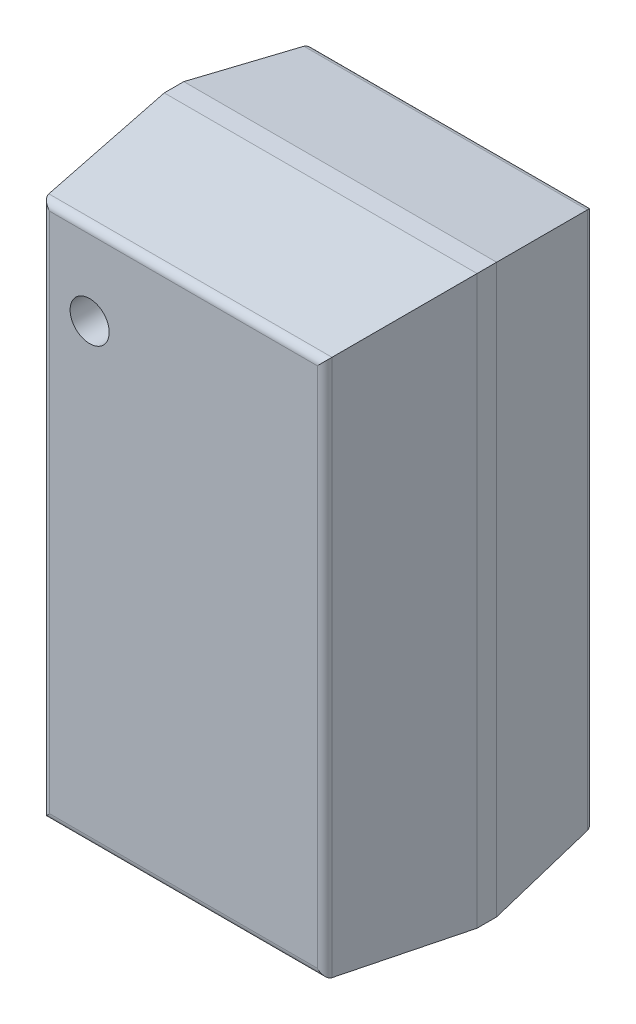
ISO-10303-21;
HEADER;
FILE_DESCRIPTION(('STEP AP214'),'2;1');
FILE_NAME('part.step','',(''),(''),'','','');
FILE_SCHEMA(('AUTOMOTIVE_DESIGN { 1 0 10303 214 1 1 1 1 }'));
ENDSEC;
DATA;
#1=APPLICATION_CONTEXT('core data for automotive mechanical design processes');
#2=APPLICATION_PROTOCOL_DEFINITION('international standard','automotive_design',2000,#1);
#3=PRODUCT_CONTEXT('',#1,'mechanical');
#4=PRODUCT('Part','Part','',(#3));
#5=PRODUCT_RELATED_PRODUCT_CATEGORY('part','',(#4));
#6=PRODUCT_DEFINITION_FORMATION('','',#4);
#7=PRODUCT_DEFINITION_CONTEXT('part definition',#1,'design');
#8=PRODUCT_DEFINITION('design','',#6,#7);
#9=PRODUCT_DEFINITION_SHAPE('','',#8);
#10=(LENGTH_UNIT() NAMED_UNIT(*) SI_UNIT(.MILLI.,.METRE.));
#11=(NAMED_UNIT(*) PLANE_ANGLE_UNIT() SI_UNIT($,.RADIAN.));
#12=(NAMED_UNIT(*) SI_UNIT($,.STERADIAN.) SOLID_ANGLE_UNIT());
#13=UNCERTAINTY_MEASURE_WITH_UNIT(LENGTH_MEASURE(1.E-05),#10,'distance_accuracy_value','');
#14=(GEOMETRIC_REPRESENTATION_CONTEXT(3) GLOBAL_UNCERTAINTY_ASSIGNED_CONTEXT((#13)) GLOBAL_UNIT_ASSIGNED_CONTEXT((#10,
#11,#12)) REPRESENTATION_CONTEXT('',''));
#15=CARTESIAN_POINT('',(0.,0.,0.));
#16=DIRECTION('',(0.,0.,1.));
#17=DIRECTION('',(1.,0.,0.));
#18=AXIS2_PLACEMENT_3D('',#15,#16,#17);
#19=CARTESIAN_POINT('',(-0.48,0.95,1.305));
#20=DIRECTION('',(0.,0.,1.));
#21=DIRECTION('',(1.,0.,0.));
#22=AXIS2_PLACEMENT_3D('',#19,#20,#21);
#23=PLANE('',#22);
#24=CARTESIAN_POINT('',(-0.48,0.95,1.305));
#25=DIRECTION('',(0.,0.,1.));
#26=DIRECTION('',(1.,0.,0.));
#27=AXIS2_PLACEMENT_3D('',#24,#25,#26);
#28=CIRCLE('',#27,0.1);
#29=CARTESIAN_POINT('',(-0.38,0.95,1.305));
#30=VERTEX_POINT('',#29);
#31=EDGE_CURVE('E25',#30,#30,#28,.T.);
#32=ORIENTED_EDGE('',*,*,#31,.T.);
#33=EDGE_LOOP('',(#32));
#34=FACE_BOUND('',#33,.T.);
#35=ADVANCED_FACE('F17',(#34),#23,.T.);
#36=CARTESIAN_POINT('',(-0.48,0.95,1.305));
#37=DIRECTION('',(0.,0.,1.));
#38=DIRECTION('',(1.,0.,0.));
#39=AXIS2_PLACEMENT_3D('',#36,#37,#38);
#40=CYLINDRICAL_SURFACE('',#39,0.1);
#41=ORIENTED_EDGE('',*,*,#31,.F.);
#42=DIRECTION('',(0.,0.,1.));
#43=VECTOR('',#42,1.);
#44=CARTESIAN_POINT('',(-0.38,0.95,1.305));
#45=LINE('',#44,#43);
#46=CARTESIAN_POINT('',(-0.38,0.95,1.45));
#47=VERTEX_POINT('',#46);
#48=EDGE_CURVE('E11',#30,#47,#45,.T.);
#49=ORIENTED_EDGE('',*,*,#48,.T.);
#50=CARTESIAN_POINT('',(-0.48,0.95,1.45));
#51=DIRECTION('',(0.,0.,1.));
#52=DIRECTION('',(1.,0.,0.));
#53=AXIS2_PLACEMENT_3D('',#50,#51,#52);
#54=CIRCLE('',#53,0.1);
#55=EDGE_CURVE('E192',#47,#47,#54,.T.);
#56=ORIENTED_EDGE('',*,*,#55,.T.);
#57=ORIENTED_EDGE('',*,*,#48,.F.);
#58=EDGE_LOOP('',(#41,#49,#56,#57));
#59=FACE_BOUND('',#58,.T.);
#60=ADVANCED_FACE('F257',(#59),#40,.F.);
#61=CARTESIAN_POINT('',(0.68430217805,-1.37,1.41));
#62=DIRECTION('',(0.,1.,0.));
#63=DIRECTION('',(0.,0.,1.));
#64=AXIS2_PLACEMENT_3D('',#61,#62,#63);
#65=CYLINDRICAL_SURFACE('',#64,0.04);
#66=CARTESIAN_POINT('',(0.68430217805,-1.33430217805,1.41));
#67=DIRECTION('',(-0.707106781186548,-0.707106781186548,0.));
#68=DIRECTION('',(0.707106781186548,-0.707106781186548,0.));
#69=AXIS2_PLACEMENT_3D('',#66,#67,#68);
#70=ELLIPSE('',#69,0.05656854249492,0.04);
#71=CARTESIAN_POINT('',(0.724044605579,-1.374044605579,1.414532047456));
#72=VERTEX_POINT('',#71);
#73=CARTESIAN_POINT('',(0.68430217805,-1.33430217805,1.45));
#74=VERTEX_POINT('',#73);
#75=EDGE_CURVE('E241',#72,#74,#70,.T.);
#76=ORIENTED_EDGE('',*,*,#75,.F.);
#77=DIRECTION('',(0.,1.,0.));
#78=VECTOR('',#77,1.);
#79=CARTESIAN_POINT('',(0.724044605579,-1.37,1.414532047456));
#80=LINE('',#79,#78);
#81=CARTESIAN_POINT('',(0.724044605579,1.374044605579,1.414532047456));
#82=VERTEX_POINT('',#81);
#83=EDGE_CURVE('E147',#72,#82,#80,.T.);
#84=ORIENTED_EDGE('',*,*,#83,.T.);
#85=CARTESIAN_POINT('',(0.68430217805,1.33430217805,1.41));
#86=DIRECTION('',(-0.707106781186548,0.707106781186548,0.));
#87=DIRECTION('',(0.707106781186548,0.707106781186548,0.));
#88=AXIS2_PLACEMENT_3D('',#85,#86,#87);
#89=ELLIPSE('',#88,0.05656854249492,0.04);
#90=CARTESIAN_POINT('',(0.68430217805,1.33430217805,1.45));
#91=VERTEX_POINT('',#90);
#92=EDGE_CURVE('E193',#91,#82,#89,.T.);
#93=ORIENTED_EDGE('',*,*,#92,.F.);
#94=DIRECTION('',(0.,1.,0.));
#95=VECTOR('',#94,1.);
#96=CARTESIAN_POINT('',(0.68430217805,-1.37,1.45));
#97=LINE('',#96,#95);
#98=EDGE_CURVE('E249',#74,#91,#97,.T.);
#99=ORIENTED_EDGE('',*,*,#98,.F.);
#100=EDGE_LOOP('',(#76,#84,#93,#99));
#101=FACE_BOUND('',#100,.T.);
#102=ADVANCED_FACE('F259',(#101),#65,.T.);
#103=CARTESIAN_POINT('',(-0.72,1.33430217805,1.41));
#104=DIRECTION('',(1.,0.,0.));
#105=DIRECTION('',(0.,0.,1.));
#106=AXIS2_PLACEMENT_3D('',#103,#104,#105);
#107=CYLINDRICAL_SURFACE('',#106,0.04);
#108=DIRECTION('',(1.,0.,0.));
#109=VECTOR('',#108,1.);
#110=CARTESIAN_POINT('',(-0.72,1.33430217805,1.45));
#111=LINE('',#110,#109);
#112=CARTESIAN_POINT('',(-0.68430217805,1.33430217805,1.45));
#113=VERTEX_POINT('',#112);
#114=EDGE_CURVE('E194',#113,#91,#111,.T.);
#115=ORIENTED_EDGE('',*,*,#114,.T.);
#116=ORIENTED_EDGE('',*,*,#92,.T.);
#117=DIRECTION('',(1.,0.,0.));
#118=VECTOR('',#117,1.);
#119=CARTESIAN_POINT('',(-0.72,1.374044605579,1.414532047456));
#120=LINE('',#119,#118);
#121=CARTESIAN_POINT('',(-0.724044605579,1.374044605579,1.414532047456));
#122=VERTEX_POINT('',#121);
#123=EDGE_CURVE('E237',#122,#82,#120,.T.);
#124=ORIENTED_EDGE('',*,*,#123,.F.);
#125=CARTESIAN_POINT('',(-0.68430217805,1.33430217805,1.41));
#126=DIRECTION('',(0.707106781186548,0.707106781186548,0.));
#127=DIRECTION('',(-0.707106781186548,0.707106781186548,0.));
#128=AXIS2_PLACEMENT_3D('',#125,#126,#127);
#129=ELLIPSE('',#128,0.05656854249492,0.04);
#130=EDGE_CURVE('E233',#122,#113,#129,.T.);
#131=ORIENTED_EDGE('',*,*,#130,.T.);
#132=EDGE_LOOP('',(#115,#116,#124,#131));
#133=FACE_BOUND('',#132,.T.);
#134=ADVANCED_FACE('F265',(#133),#107,.T.);
#135=CARTESIAN_POINT('',(-0.8,-1.45,1.45));
#136=DIRECTION('',(0.,0.,1.));
#137=DIRECTION('',(1.,0.,0.));
#138=AXIS2_PLACEMENT_3D('',#135,#136,#137);
#139=PLANE('',#138);
#140=ORIENTED_EDGE('',*,*,#55,.F.);
#141=EDGE_LOOP('',(#140));
#142=FACE_BOUND('',#141,.T.);
#143=DIRECTION('',(0.,1.,0.));
#144=VECTOR('',#143,1.);
#145=CARTESIAN_POINT('',(-0.68430217805,-1.37,1.45));
#146=LINE('',#145,#144);
#147=CARTESIAN_POINT('',(-0.68430217805,-1.33430217805,1.45));
#148=VERTEX_POINT('',#147);
#149=EDGE_CURVE('E229',#148,#113,#146,.T.);
#150=ORIENTED_EDGE('',*,*,#149,.F.);
#151=DIRECTION('',(1.,0.,0.));
#152=VECTOR('',#151,1.);
#153=CARTESIAN_POINT('',(-0.72,-1.33430217805,1.45));
#154=LINE('',#153,#152);
#155=EDGE_CURVE('E245',#148,#74,#154,.T.);
#156=ORIENTED_EDGE('',*,*,#155,.T.);
#157=ORIENTED_EDGE('',*,*,#98,.T.);
#158=ORIENTED_EDGE('',*,*,#114,.F.);
#159=EDGE_LOOP('',(#150,#156,#157,#158));
#160=FACE_BOUND('',#159,.T.);
#161=ADVANCED_FACE('F271',(#142,#160),#139,.T.);
#162=CARTESIAN_POINT('',(-0.72,-1.33430217805,1.41));
#163=DIRECTION('',(1.,0.,0.));
#164=DIRECTION('',(0.,-0.993560688212825,0.11330118639298));
#165=AXIS2_PLACEMENT_3D('',#162,#163,#164);
#166=CYLINDRICAL_SURFACE('',#165,0.04);
#167=DIRECTION('',(1.,0.,0.));
#168=VECTOR('',#167,1.);
#169=CARTESIAN_POINT('',(-0.72,-1.374044605579,1.414532047456));
#170=LINE('',#169,#168);
#171=CARTESIAN_POINT('',(-0.724044605579,-1.374044605579,1.414532047456));
#172=VERTEX_POINT('',#171);
#173=EDGE_CURVE('E153',#172,#72,#170,.T.);
#174=ORIENTED_EDGE('',*,*,#173,.T.);
#175=ORIENTED_EDGE('',*,*,#75,.T.);
#176=ORIENTED_EDGE('',*,*,#155,.F.);
#177=CARTESIAN_POINT('',(-0.68430217805,-1.33430217805,1.41));
#178=DIRECTION('',(-0.707106781186548,0.707106781186548,0.));
#179=DIRECTION('',(0.707106781186548,0.707106781186548,0.));
#180=AXIS2_PLACEMENT_3D('',#177,#178,#179);
#181=ELLIPSE('',#180,0.05656854249492,0.04);
#182=EDGE_CURVE('E225',#172,#148,#181,.T.);
#183=ORIENTED_EDGE('',*,*,#182,.F.);
#184=EDGE_LOOP('',(#174,#175,#176,#183));
#185=FACE_BOUND('',#184,.T.);
#186=ADVANCED_FACE('F275',(#185),#166,.T.);
#187=CARTESIAN_POINT('',(0.76,-1.45,1.099232026655));
#188=DIRECTION('',(0.993560688212825,0.,0.11330118639298));
#189=DIRECTION('',(0.,-1.,0.));
#190=AXIS2_PLACEMENT_3D('',#187,#188,#189);
#191=PLANE('',#190);
#192=DIRECTION('',(-0.112580881361013,0.112580881361013,0.987244189805114));
#193=VECTOR('',#192,1.);
#194=CARTESIAN_POINT('',(0.750367414316,-1.400367414316,1.18370209062));
#195=LINE('',#194,#193);
#196=CARTESIAN_POINT('',(0.8,-1.45,0.74846405331));
#197=VERTEX_POINT('',#196);
#198=EDGE_CURVE('E140',#197,#72,#195,.T.);
#199=ORIENTED_EDGE('',*,*,#198,.F.);
#200=DIRECTION('',(0.,1.,0.));
#201=VECTOR('',#200,1.);
#202=CARTESIAN_POINT('',(0.8,-1.45,0.74846405331));
#203=LINE('',#202,#201);
#204=CARTESIAN_POINT('',(0.8,1.45,0.74846405331));
#205=VERTEX_POINT('',#204);
#206=EDGE_CURVE('E144',#197,#205,#203,.T.);
#207=ORIENTED_EDGE('',*,*,#206,.T.);
#208=DIRECTION('',(-0.112580881361013,-0.112580881361013,0.987244189805114));
#209=VECTOR('',#208,1.);
#210=CARTESIAN_POINT('',(0.731989454786,1.381989454786,1.344862081079));
#211=LINE('',#210,#209);
#212=EDGE_CURVE('E238',#205,#82,#211,.T.);
#213=ORIENTED_EDGE('',*,*,#212,.T.);
#214=ORIENTED_EDGE('',*,*,#83,.F.);
#215=EDGE_LOOP('',(#199,#207,#213,#214));
#216=FACE_BOUND('',#215,.T.);
#217=ADVANCED_FACE('F142',(#216),#191,.T.);
#218=CARTESIAN_POINT('',(-0.8,1.41,1.099232026655));
#219=DIRECTION('',(0.,0.993560688212825,0.11330118639298));
#220=DIRECTION('',(1.,0.,0.));
#221=AXIS2_PLACEMENT_3D('',#218,#219,#220);
#222=PLANE('',#221);
#223=ORIENTED_EDGE('',*,*,#123,.T.);
#224=ORIENTED_EDGE('',*,*,#212,.F.);
#225=DIRECTION('',(1.,0.,0.));
#226=VECTOR('',#225,1.);
#227=CARTESIAN_POINT('',(-0.8,1.45,0.74846405331));
#228=LINE('',#227,#226);
#229=CARTESIAN_POINT('',(-0.8,1.45,0.74846405331));
#230=VERTEX_POINT('',#229);
#231=EDGE_CURVE('E165',#230,#205,#228,.T.);
#232=ORIENTED_EDGE('',*,*,#231,.F.);
#233=DIRECTION('',(0.112580881361013,-0.112580881361013,0.987244189805114));
#234=VECTOR('',#233,1.);
#235=CARTESIAN_POINT('',(-0.742129018664,1.392129018664,1.255946224274));
#236=LINE('',#235,#234);
#237=EDGE_CURVE('E217',#230,#122,#236,.T.);
#238=ORIENTED_EDGE('',*,*,#237,.T.);
#239=EDGE_LOOP('',(#223,#224,#232,#238));
#240=FACE_BOUND('',#239,.T.);
#241=ADVANCED_FACE('F282',(#240),#222,.T.);
#242=CARTESIAN_POINT('',(-0.68430217805,-1.37,1.41));
#243=DIRECTION('',(0.,1.,0.));
#244=DIRECTION('',(-0.993560688212825,0.,0.11330118639298));
#245=AXIS2_PLACEMENT_3D('',#242,#243,#244);
#246=CYLINDRICAL_SURFACE('',#245,0.04);
#247=ORIENTED_EDGE('',*,*,#182,.T.);
#248=ORIENTED_EDGE('',*,*,#149,.T.);
#249=ORIENTED_EDGE('',*,*,#130,.F.);
#250=DIRECTION('',(0.,1.,0.));
#251=VECTOR('',#250,1.);
#252=CARTESIAN_POINT('',(-0.724044605579,-1.37,1.414532047456));
#253=LINE('',#252,#251);
#254=EDGE_CURVE('E213',#172,#122,#253,.T.);
#255=ORIENTED_EDGE('',*,*,#254,.F.);
#256=EDGE_LOOP('',(#247,#248,#249,#255));
#257=FACE_BOUND('',#256,.T.);
#258=ADVANCED_FACE('F285',(#257),#246,.T.);
#259=CARTESIAN_POINT('',(-0.8,-1.41,1.099232026655));
#260=DIRECTION('',(0.,0.993560688212825,-0.11330118639298));
#261=DIRECTION('',(-1.,0.,0.));
#262=AXIS2_PLACEMENT_3D('',#259,#260,#261);
#263=PLANE('',#262);
#264=DIRECTION('',(0.112580881361013,0.112580881361013,0.987244189805114));
#265=VECTOR('',#264,1.);
#266=CARTESIAN_POINT('',(-0.760506978194,-1.410506978194,1.094786233815));
#267=LINE('',#266,#265);
#268=CARTESIAN_POINT('',(-0.8,-1.45,0.74846405331));
#269=VERTEX_POINT('',#268);
#270=EDGE_CURVE('E180',#269,#172,#267,.T.);
#271=ORIENTED_EDGE('',*,*,#270,.F.);
#272=DIRECTION('',(1.,0.,0.));
#273=VECTOR('',#272,1.);
#274=CARTESIAN_POINT('',(-0.8,-1.45,0.74846405331));
#275=LINE('',#274,#273);
#276=EDGE_CURVE('E170',#269,#197,#275,.T.);
#277=ORIENTED_EDGE('',*,*,#276,.T.);
#278=ORIENTED_EDGE('',*,*,#198,.T.);
#279=ORIENTED_EDGE('',*,*,#173,.F.);
#280=EDGE_LOOP('',(#271,#277,#278,#279));
#281=FACE_BOUND('',#280,.T.);
#282=ADVANCED_FACE('F178',(#281),#263,.F.);
#283=CARTESIAN_POINT('',(0.8,-1.45,0.075));
#284=DIRECTION('',(1.,0.,0.));
#285=DIRECTION('',(0.,1.,0.));
#286=AXIS2_PLACEMENT_3D('',#283,#284,#285);
#287=PLANE('',#286);
#288=DIRECTION('',(0.,0.,1.));
#289=VECTOR('',#288,1.);
#290=CARTESIAN_POINT('',(0.8,-1.45,0.075));
#291=LINE('',#290,#289);
#292=CARTESIAN_POINT('',(0.8,-1.45,0.64846405331));
#293=VERTEX_POINT('',#292);
#294=EDGE_CURVE('E161',#293,#197,#291,.T.);
#295=ORIENTED_EDGE('',*,*,#294,.F.);
#296=DIRECTION('',(0.,1.,0.));
#297=VECTOR('',#296,1.);
#298=CARTESIAN_POINT('',(0.8,-1.45,0.64846405331));
#299=LINE('',#298,#297);
#300=CARTESIAN_POINT('',(0.8,1.45,0.64846405331));
#301=VERTEX_POINT('',#300);
#302=EDGE_CURVE('E201',#293,#301,#299,.T.);
#303=ORIENTED_EDGE('',*,*,#302,.T.);
#304=DIRECTION('',(0.,0.,1.));
#305=VECTOR('',#304,1.);
#306=CARTESIAN_POINT('',(0.8,1.45,0.075));
#307=LINE('',#306,#305);
#308=EDGE_CURVE('E163',#301,#205,#307,.T.);
#309=ORIENTED_EDGE('',*,*,#308,.T.);
#310=ORIENTED_EDGE('',*,*,#206,.F.);
#311=EDGE_LOOP('',(#295,#303,#309,#310));
#312=FACE_BOUND('',#311,.T.);
#313=ADVANCED_FACE('F159',(#312),#287,.T.);
#314=CARTESIAN_POINT('',(0.685192776379,-1.37,0.115));
#315=DIRECTION('',(0.,1.,0.));
#316=DIRECTION('',(0.,0.,-1.));
#317=AXIS2_PLACEMENT_3D('',#314,#315,#316);
#318=CYLINDRICAL_SURFACE('',#317,0.04);
#319=DIRECTION('',(0.,1.,0.));
#320=VECTOR('',#319,1.);
#321=CARTESIAN_POINT('',(0.685192776379,-1.37,0.075));
#322=LINE('',#321,#320);
#323=CARTESIAN_POINT('',(0.685192776379,-1.335192776379,0.075));
#324=VERTEX_POINT('',#323);
#325=CARTESIAN_POINT('',(0.685192776379,1.335192776379,0.075));
#326=VERTEX_POINT('',#325);
#327=EDGE_CURVE('E206',#324,#326,#322,.T.);
#328=ORIENTED_EDGE('',*,*,#327,.T.);
#329=CARTESIAN_POINT('',(0.685192776379,1.335192776379,0.115));
#330=DIRECTION('',(0.707106781186548,-0.707106781186548,0.));
#331=DIRECTION('',(0.707106781186548,0.707106781186548,0.));
#332=AXIS2_PLACEMENT_3D('',#329,#330,#331);
#333=ELLIPSE('',#332,0.05656854249492,0.04);
#334=CARTESIAN_POINT('',(0.72480914464,1.37480914464,0.109473394727));
#335=VERTEX_POINT('',#334);
#336=EDGE_CURVE('E210',#326,#335,#333,.T.);
#337=ORIENTED_EDGE('',*,*,#336,.T.);
#338=DIRECTION('',(0.,1.,0.));
#339=VECTOR('',#338,1.);
#340=CARTESIAN_POINT('',(0.72480914464,-1.37,0.109473394727));
#341=LINE('',#340,#339);
#342=CARTESIAN_POINT('',(0.72480914464,-1.37480914464,0.109473394727));
#343=VERTEX_POINT('',#342);
#344=EDGE_CURVE('E176',#343,#335,#341,.T.);
#345=ORIENTED_EDGE('',*,*,#344,.F.);
#346=CARTESIAN_POINT('',(0.685192776379,-1.335192776379,0.115));
#347=DIRECTION('',(0.707106781186548,0.707106781186548,0.));
#348=DIRECTION('',(0.707106781186548,-0.707106781186548,0.));
#349=AXIS2_PLACEMENT_3D('',#346,#347,#348);
#350=ELLIPSE('',#349,0.05656854249492,0.04);
#351=EDGE_CURVE('E182',#343,#324,#350,.T.);
#352=ORIENTED_EDGE('',*,*,#351,.T.);
#353=EDGE_LOOP('',(#328,#337,#345,#352));
#354=FACE_BOUND('',#353,.T.);
#355=ADVANCED_FACE('F291',(#354),#318,.T.);
#356=CARTESIAN_POINT('',(-0.8,1.45,0.075));
#357=DIRECTION('',(0.,1.,0.));
#358=DIRECTION('',(1.,0.,0.));
#359=AXIS2_PLACEMENT_3D('',#356,#357,#358);
#360=PLANE('',#359);
#361=ORIENTED_EDGE('',*,*,#308,.F.);
#362=DIRECTION('',(1.,0.,0.));
#363=VECTOR('',#362,1.);
#364=CARTESIAN_POINT('',(-0.8,1.45,0.64846405331));
#365=LINE('',#364,#363);
#366=CARTESIAN_POINT('',(-0.8,1.45,0.64846405331));
#367=VERTEX_POINT('',#366);
#368=EDGE_CURVE('E402',#367,#301,#365,.T.);
#369=ORIENTED_EDGE('',*,*,#368,.F.);
#370=DIRECTION('',(0.,0.,1.));
#371=VECTOR('',#370,1.);
#372=CARTESIAN_POINT('',(-0.8,1.45,0.075));
#373=LINE('',#372,#371);
#374=EDGE_CURVE('E403',#367,#230,#373,.T.);
#375=ORIENTED_EDGE('',*,*,#374,.T.);
#376=ORIENTED_EDGE('',*,*,#231,.T.);
#377=EDGE_LOOP('',(#361,#369,#375,#376));
#378=FACE_BOUND('',#377,.T.);
#379=ADVANCED_FACE('F296',(#378),#360,.T.);
#380=CARTESIAN_POINT('',(-0.76,-1.45,1.099232026655));
#381=DIRECTION('',(0.993560688212825,0.,-0.11330118639298));
#382=DIRECTION('',(0.,-1.,0.));
#383=AXIS2_PLACEMENT_3D('',#380,#381,#382);
#384=PLANE('',#383);
#385=ORIENTED_EDGE('',*,*,#254,.T.);
#386=ORIENTED_EDGE('',*,*,#237,.F.);
#387=DIRECTION('',(0.,1.,0.));
#388=VECTOR('',#387,1.);
#389=CARTESIAN_POINT('',(-0.8,-1.45,0.74846405331));
#390=LINE('',#389,#388);
#391=EDGE_CURVE('E398',#269,#230,#390,.T.);
#392=ORIENTED_EDGE('',*,*,#391,.F.);
#393=ORIENTED_EDGE('',*,*,#270,.T.);
#394=EDGE_LOOP('',(#385,#386,#392,#393));
#395=FACE_BOUND('',#394,.T.);
#396=ADVANCED_FACE('F292',(#395),#384,.F.);
#397=CARTESIAN_POINT('',(-0.72,1.335192776379,0.115));
#398=DIRECTION('',(1.,0.,0.));
#399=DIRECTION('',(0.,0.,-1.));
#400=AXIS2_PLACEMENT_3D('',#397,#398,#399);
#401=CYLINDRICAL_SURFACE('',#400,0.04);
#402=CARTESIAN_POINT('',(-0.685192776379,1.335192776379,0.115));
#403=DIRECTION('',(-0.707106781186548,-0.707106781186548,0.));
#404=DIRECTION('',(-0.707106781186548,0.707106781186548,0.));
#405=AXIS2_PLACEMENT_3D('',#402,#403,#404);
#406=ELLIPSE('',#405,0.05656854249492,0.04);
#407=CARTESIAN_POINT('',(-0.72480914464,1.37480914464,0.109473394727));
#408=VERTEX_POINT('',#407);
#409=CARTESIAN_POINT('',(-0.685192776379,1.335192776379,0.075));
#410=VERTEX_POINT('',#409);
#411=EDGE_CURVE('E369',#408,#410,#406,.T.);
#412=ORIENTED_EDGE('',*,*,#411,.F.);
#413=DIRECTION('',(1.,0.,0.));
#414=VECTOR('',#413,1.);
#415=CARTESIAN_POINT('',(-0.72,1.37480914464,0.109473394727));
#416=LINE('',#415,#414);
#417=EDGE_CURVE('E390',#408,#335,#416,.T.);
#418=ORIENTED_EDGE('',*,*,#417,.T.);
#419=ORIENTED_EDGE('',*,*,#336,.F.);
#420=DIRECTION('',(1.,0.,0.));
#421=VECTOR('',#420,1.);
#422=CARTESIAN_POINT('',(-0.72,1.335192776379,0.075));
#423=LINE('',#422,#421);
#424=EDGE_CURVE('E202',#410,#326,#423,.T.);
#425=ORIENTED_EDGE('',*,*,#424,.F.);
#426=EDGE_LOOP('',(#412,#418,#419,#425));
#427=FACE_BOUND('',#426,.T.);
#428=ADVANCED_FACE('F295',(#427),#401,.T.);
#429=CARTESIAN_POINT('',(-0.8,-1.45,0.075));
#430=DIRECTION('',(0.,0.,1.));
#431=DIRECTION('',(1.,0.,0.));
#432=AXIS2_PLACEMENT_3D('',#429,#430,#431);
#433=PLANE('',#432);
#434=ORIENTED_EDGE('',*,*,#424,.T.);
#435=ORIENTED_EDGE('',*,*,#327,.F.);
#436=DIRECTION('',(1.,0.,0.));
#437=VECTOR('',#436,1.);
#438=CARTESIAN_POINT('',(-0.72,-1.335192776379,0.075));
#439=LINE('',#438,#437);
#440=CARTESIAN_POINT('',(-0.685192776379,-1.335192776379,0.075));
#441=VERTEX_POINT('',#440);
#442=EDGE_CURVE('E188',#441,#324,#439,.T.);
#443=ORIENTED_EDGE('',*,*,#442,.F.);
#444=DIRECTION('',(0.,1.,0.));
#445=VECTOR('',#444,1.);
#446=CARTESIAN_POINT('',(-0.685192776379,-1.37,0.075));
#447=LINE('',#446,#445);
#448=EDGE_CURVE('E373',#441,#410,#447,.T.);
#449=ORIENTED_EDGE('',*,*,#448,.T.);
#450=EDGE_LOOP('',(#434,#435,#443,#449));
#451=FACE_BOUND('',#450,.T.);
#452=ADVANCED_FACE('F298',(#451),#433,.F.);
#453=CARTESIAN_POINT('',(0.76,-1.45,0.361732026655));
#454=DIRECTION('',(-0.990409206514318,0.,0.138165131823044));
#455=DIRECTION('',(0.,1.,0.));
#456=AXIS2_PLACEMENT_3D('',#453,#454,#455);
#457=PLANE('',#456);
#458=ORIENTED_EDGE('',*,*,#344,.T.);
#459=DIRECTION('',(-0.136864958531939,-0.136864958531939,-0.981089173445565));
#460=VECTOR('',#459,1.);
#461=CARTESIAN_POINT('',(0.718602242709,1.368602242709,0.06498045547816));
#462=LINE('',#461,#460);
#463=EDGE_CURVE('E394',#301,#335,#462,.T.);
#464=ORIENTED_EDGE('',*,*,#463,.F.);
#465=ORIENTED_EDGE('',*,*,#302,.F.);
#466=DIRECTION('',(-0.136864958531939,0.136864958531939,-0.981089173445565));
#467=VECTOR('',#466,1.);
#468=CARTESIAN_POINT('',(0.745763667176,-1.395763667176,0.259681712585));
#469=LINE('',#468,#467);
#470=EDGE_CURVE('E365',#293,#343,#469,.T.);
#471=ORIENTED_EDGE('',*,*,#470,.T.);
#472=EDGE_LOOP('',(#458,#464,#465,#471));
#473=FACE_BOUND('',#472,.T.);
#474=ADVANCED_FACE('F301',(#473),#457,.F.);
#475=CARTESIAN_POINT('',(-0.8,-1.45,0.075));
#476=DIRECTION('',(0.,1.,0.));
#477=DIRECTION('',(1.,0.,0.));
#478=AXIS2_PLACEMENT_3D('',#475,#476,#477);
#479=PLANE('',#478);
#480=ORIENTED_EDGE('',*,*,#276,.F.);
#481=DIRECTION('',(0.,0.,1.));
#482=VECTOR('',#481,1.);
#483=CARTESIAN_POINT('',(-0.8,-1.45,0.075));
#484=LINE('',#483,#482);
#485=CARTESIAN_POINT('',(-0.8,-1.45,0.64846405331));
#486=VERTEX_POINT('',#485);
#487=EDGE_CURVE('E399',#486,#269,#484,.T.);
#488=ORIENTED_EDGE('',*,*,#487,.F.);
#489=DIRECTION('',(1.,0.,0.));
#490=VECTOR('',#489,1.);
#491=CARTESIAN_POINT('',(-0.8,-1.45,0.64846405331));
#492=LINE('',#491,#490);
#493=EDGE_CURVE('E173',#486,#293,#492,.T.);
#494=ORIENTED_EDGE('',*,*,#493,.T.);
#495=ORIENTED_EDGE('',*,*,#294,.T.);
#496=EDGE_LOOP('',(#480,#488,#494,#495));
#497=FACE_BOUND('',#496,.T.);
#498=ADVANCED_FACE('F169',(#497),#479,.F.);
#499=CARTESIAN_POINT('',(-0.72,-1.335192776379,0.115));
#500=DIRECTION('',(1.,0.,0.));
#501=DIRECTION('',(0.,-0.990409206514318,-0.138165131823044));
#502=AXIS2_PLACEMENT_3D('',#499,#500,#501);
#503=CYLINDRICAL_SURFACE('',#502,0.04);
#504=CARTESIAN_POINT('',(-0.685192776379,-1.335192776379,0.115));
#505=DIRECTION('',(0.707106781186548,-0.707106781186548,0.));
#506=DIRECTION('',(0.707106781186548,0.707106781186548,0.));
#507=AXIS2_PLACEMENT_3D('',#504,#505,#506);
#508=ELLIPSE('',#507,0.05656854249492,0.04);
#509=CARTESIAN_POINT('',(-0.72480914464,-1.37480914464,0.109473394727));
#510=VERTEX_POINT('',#509);
#511=EDGE_CURVE('E387',#510,#441,#508,.T.);
#512=ORIENTED_EDGE('',*,*,#511,.T.);
#513=ORIENTED_EDGE('',*,*,#442,.T.);
#514=ORIENTED_EDGE('',*,*,#351,.F.);
#515=DIRECTION('',(1.,0.,0.));
#516=VECTOR('',#515,1.);
#517=CARTESIAN_POINT('',(-0.72,-1.37480914464,0.109473394727));
#518=LINE('',#517,#516);
#519=EDGE_CURVE('E364',#510,#343,#518,.T.);
#520=ORIENTED_EDGE('',*,*,#519,.F.);
#521=EDGE_LOOP('',(#512,#513,#514,#520));
#522=FACE_BOUND('',#521,.T.);
#523=ADVANCED_FACE('F308',(#522),#503,.T.);
#524=CARTESIAN_POINT('',(-0.8,1.41,0.361732026655));
#525=DIRECTION('',(0.,-0.990409206514318,0.138165131823044));
#526=DIRECTION('',(-1.,0.,0.));
#527=AXIS2_PLACEMENT_3D('',#524,#525,#526);
#528=PLANE('',#527);
#529=DIRECTION('',(0.136864958531939,-0.136864958531939,-0.981089173445565));
#530=VECTOR('',#529,1.);
#531=CARTESIAN_POINT('',(-0.733587856208,1.383587856208,0.17240183871));
#532=LINE('',#531,#530);
#533=EDGE_CURVE('E361',#367,#408,#532,.T.);
#534=ORIENTED_EDGE('',*,*,#533,.F.);
#535=ORIENTED_EDGE('',*,*,#368,.T.);
#536=ORIENTED_EDGE('',*,*,#463,.T.);
#537=ORIENTED_EDGE('',*,*,#417,.F.);
#538=EDGE_LOOP('',(#534,#535,#536,#537));
#539=FACE_BOUND('',#538,.T.);
#540=ADVANCED_FACE('F317',(#539),#528,.F.);
#541=CARTESIAN_POINT('',(-0.8,-1.45,0.075));
#542=DIRECTION('',(1.,0.,0.));
#543=DIRECTION('',(0.,1.,0.));
#544=AXIS2_PLACEMENT_3D('',#541,#542,#543);
#545=PLANE('',#544);
#546=ORIENTED_EDGE('',*,*,#391,.T.);
#547=ORIENTED_EDGE('',*,*,#374,.F.);
#548=DIRECTION('',(0.,1.,0.));
#549=VECTOR('',#548,1.);
#550=CARTESIAN_POINT('',(-0.8,-1.45,0.64846405331));
#551=LINE('',#550,#549);
#552=EDGE_CURVE('E352',#486,#367,#551,.T.);
#553=ORIENTED_EDGE('',*,*,#552,.F.);
#554=ORIENTED_EDGE('',*,*,#487,.T.);
#555=EDGE_LOOP('',(#546,#547,#553,#554));
#556=FACE_BOUND('',#555,.T.);
#557=ADVANCED_FACE('F322',(#556),#545,.F.);
#558=CARTESIAN_POINT('',(-0.685192776379,-1.37,0.115));
#559=DIRECTION('',(0.,1.,0.));
#560=DIRECTION('',(-0.990409206514318,0.,-0.138165131823044));
#561=AXIS2_PLACEMENT_3D('',#558,#559,#560);
#562=CYLINDRICAL_SURFACE('',#561,0.04);
#563=DIRECTION('',(0.,1.,0.));
#564=VECTOR('',#563,1.);
#565=CARTESIAN_POINT('',(-0.72480914464,-1.37,0.109473394727));
#566=LINE('',#565,#564);
#567=EDGE_CURVE('E354',#510,#408,#566,.T.);
#568=ORIENTED_EDGE('',*,*,#567,.T.);
#569=ORIENTED_EDGE('',*,*,#411,.T.);
#570=ORIENTED_EDGE('',*,*,#448,.F.);
#571=ORIENTED_EDGE('',*,*,#511,.F.);
#572=EDGE_LOOP('',(#568,#569,#570,#571));
#573=FACE_BOUND('',#572,.T.);
#574=ADVANCED_FACE('F325',(#573),#562,.T.);
#575=CARTESIAN_POINT('',(-0.8,-1.41,0.361732026655));
#576=DIRECTION('',(0.,-0.990409206514318,-0.138165131823044));
#577=DIRECTION('',(0.,0.138165131823044,-0.990409206514318));
#578=AXIS2_PLACEMENT_3D('',#575,#576,#577);
#579=PLANE('',#578);
#580=ORIENTED_EDGE('',*,*,#519,.T.);
#581=ORIENTED_EDGE('',*,*,#470,.F.);
#582=ORIENTED_EDGE('',*,*,#493,.F.);
#583=DIRECTION('',(0.136864958531939,0.136864958531939,-0.981089173445565));
#584=VECTOR('',#583,1.);
#585=CARTESIAN_POINT('',(-0.760749280675,-1.410749280675,0.367103095817));
#586=LINE('',#585,#584);
#587=EDGE_CURVE('E349',#486,#510,#586,.T.);
#588=ORIENTED_EDGE('',*,*,#587,.T.);
#589=EDGE_LOOP('',(#580,#581,#582,#588));
#590=FACE_BOUND('',#589,.T.);
#591=ADVANCED_FACE('F329',(#590),#579,.T.);
#592=CARTESIAN_POINT('',(-0.76,-1.45,0.361732026655));
#593=DIRECTION('',(-0.990409206514318,0.,-0.138165131823044));
#594=DIRECTION('',(-0.138165131823044,0.,0.990409206514318));
#595=AXIS2_PLACEMENT_3D('',#592,#593,#594);
#596=PLANE('',#595);
#597=ORIENTED_EDGE('',*,*,#587,.F.);
#598=ORIENTED_EDGE('',*,*,#552,.T.);
#599=ORIENTED_EDGE('',*,*,#533,.T.);
#600=ORIENTED_EDGE('',*,*,#567,.F.);
#601=EDGE_LOOP('',(#597,#598,#599,#600));
#602=FACE_BOUND('',#601,.T.);
#603=ADVANCED_FACE('F336',(#602),#596,.T.);
#604=CLOSED_SHELL('',(#35,#60,#102,#134,#161,#186,#217,#241,#258,#282,#313,#355,#379,#396,#428,
#452,#474,#498,#523,#540,#557,#574,#591,#603));
#605=MANIFOLD_SOLID_BREP('B1',#604);
#606=ADVANCED_BREP_SHAPE_REPRESENTATION('',(#18,#605),#14);
#607=SHAPE_DEFINITION_REPRESENTATION(#9,#606);
ENDSEC;
END-ISO-10303-21;
